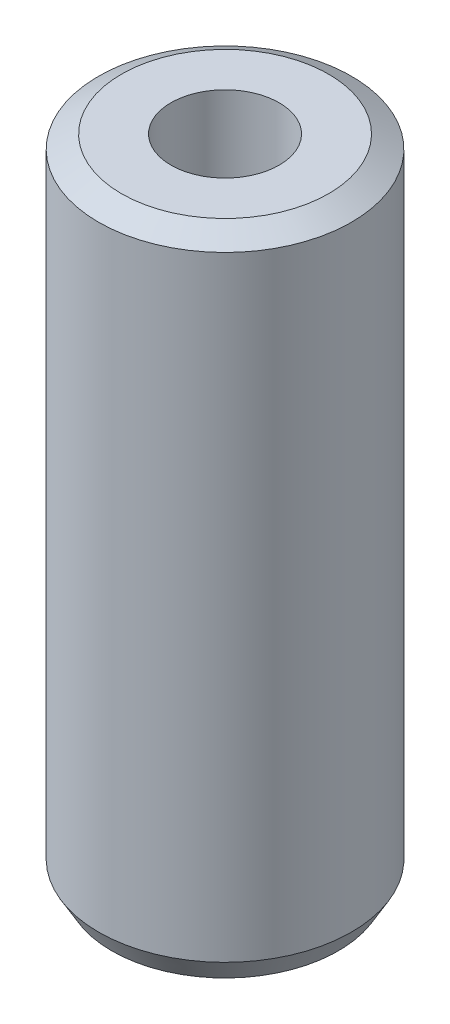
ISO-10303-21;
HEADER;
FILE_DESCRIPTION(('STEP AP214'),'2;1');
FILE_NAME('part.step','',(''),(''),'','','');
FILE_SCHEMA(('AUTOMOTIVE_DESIGN { 1 0 10303 214 1 1 1 1 }'));
ENDSEC;
DATA;
#1=APPLICATION_CONTEXT('core data for automotive mechanical design processes');
#2=APPLICATION_PROTOCOL_DEFINITION('international standard','automotive_design',2000,#1);
#3=PRODUCT_CONTEXT('',#1,'mechanical');
#4=PRODUCT('Part','Part','',(#3));
#5=PRODUCT_RELATED_PRODUCT_CATEGORY('part','',(#4));
#6=PRODUCT_DEFINITION_FORMATION('','',#4);
#7=PRODUCT_DEFINITION_CONTEXT('part definition',#1,'design');
#8=PRODUCT_DEFINITION('design','',#6,#7);
#9=PRODUCT_DEFINITION_SHAPE('','',#8);
#10=(LENGTH_UNIT() NAMED_UNIT(*) SI_UNIT(.MILLI.,.METRE.));
#11=(NAMED_UNIT(*) PLANE_ANGLE_UNIT() SI_UNIT($,.RADIAN.));
#12=(NAMED_UNIT(*) SI_UNIT($,.STERADIAN.) SOLID_ANGLE_UNIT());
#13=UNCERTAINTY_MEASURE_WITH_UNIT(LENGTH_MEASURE(1.E-05),#10,'distance_accuracy_value','');
#14=(GEOMETRIC_REPRESENTATION_CONTEXT(3) GLOBAL_UNCERTAINTY_ASSIGNED_CONTEXT((#13)) GLOBAL_UNIT_ASSIGNED_CONTEXT((#10,
#11,#12)) REPRESENTATION_CONTEXT('',''));
#15=CARTESIAN_POINT('',(0.,0.,0.));
#16=DIRECTION('',(0.,0.,1.));
#17=DIRECTION('',(1.,0.,0.));
#18=AXIS2_PLACEMENT_3D('',#15,#16,#17);
#19=CARTESIAN_POINT('',(0.,231.583665845581,0.));
#20=DIRECTION('',(0.,-1.,0.));
#21=DIRECTION('',(0.,0.,-1.));
#22=AXIS2_PLACEMENT_3D('',#19,#20,#21);
#23=CYLINDRICAL_SURFACE('',#22,45.);
#24=CARTESIAN_POINT('',(0.,226.878388832589,0.));
#25=DIRECTION('',(0.,1.,0.));
#26=DIRECTION('',(0.,0.,1.));
#27=AXIS2_PLACEMENT_3D('',#24,#25,#26);
#28=CIRCLE('',#27,45.);
#29=CARTESIAN_POINT('',(0.,226.878388832589,45.));
#30=VERTEX_POINT('',#29);
#31=EDGE_CURVE('E50',#30,#30,#28,.F.);
#32=ORIENTED_EDGE('',*,*,#31,.T.);
#33=EDGE_LOOP('',(#32));
#34=FACE_BOUND('',#33,.T.);
#35=CARTESIAN_POINT('',(0.,8.14977885018772,0.));
#36=DIRECTION('',(0.,1.,0.));
#37=DIRECTION('',(0.,0.,1.));
#38=AXIS2_PLACEMENT_3D('',#35,#36,#37);
#39=CIRCLE('',#38,45.);
#40=CARTESIAN_POINT('',(0.,8.14977885018772,45.));
#41=VERTEX_POINT('',#40);
#42=EDGE_CURVE('E51',#41,#41,#39,.T.);
#43=ORIENTED_EDGE('',*,*,#42,.T.);
#44=EDGE_LOOP('',(#43));
#45=FACE_BOUND('',#44,.T.);
#46=ADVANCED_FACE('F39',(#34,#45),#23,.T.);
#47=CARTESIAN_POINT('',(0.,231.583665845581,0.));
#48=DIRECTION('',(0.,1.,0.));
#49=DIRECTION('',(0.,0.,1.));
#50=AXIS2_PLACEMENT_3D('',#47,#48,#49);
#51=PLANE('',#50);
#52=CARTESIAN_POINT('',(0.,231.583665845581,0.));
#53=DIRECTION('',(0.,1.,0.));
#54=DIRECTION('',(0.,0.,1.));
#55=AXIS2_PLACEMENT_3D('',#52,#53,#54);
#56=CIRCLE('',#55,36.8502211498124);
#57=CARTESIAN_POINT('',(0.,231.583665845581,36.8502211498124));
#58=VERTEX_POINT('',#57);
#59=EDGE_CURVE('E54',#58,#58,#56,.T.);
#60=ORIENTED_EDGE('',*,*,#59,.T.);
#61=EDGE_LOOP('',(#60));
#62=FACE_BOUND('',#61,.T.);
#63=CARTESIAN_POINT('',(0.,231.583665845581,0.));
#64=DIRECTION('',(0.,1.,0.));
#65=DIRECTION('',(0.,0.,1.));
#66=AXIS2_PLACEMENT_3D('',#63,#64,#65);
#67=CIRCLE('',#66,19.2531426850835);
#68=CARTESIAN_POINT('',(0.,231.583665845581,19.2531426850835));
#69=VERTEX_POINT('',#68);
#70=EDGE_CURVE('E58',#69,#69,#67,.T.);
#71=ORIENTED_EDGE('',*,*,#70,.F.);
#72=EDGE_LOOP('',(#71));
#73=FACE_BOUND('',#72,.T.);
#74=ADVANCED_FACE('F69',(#62,#73),#51,.T.);
#75=CARTESIAN_POINT('',(0.,0.,0.));
#76=DIRECTION('',(0.,1.,0.));
#77=DIRECTION('',(0.,0.,1.));
#78=AXIS2_PLACEMENT_3D('',#75,#76,#77);
#79=PLANE('',#78);
#80=CARTESIAN_POINT('',(0.,0.,0.));
#81=DIRECTION('',(0.,1.,0.));
#82=DIRECTION('',(0.,0.,1.));
#83=AXIS2_PLACEMENT_3D('',#80,#81,#82);
#84=CIRCLE('',#83,40.2947229870082);
#85=CARTESIAN_POINT('',(0.,0.,40.2947229870082));
#86=VERTEX_POINT('',#85);
#87=EDGE_CURVE('E10',#86,#86,#84,.F.);
#88=ORIENTED_EDGE('',*,*,#87,.T.);
#89=EDGE_LOOP('',(#88));
#90=FACE_BOUND('',#89,.T.);
#91=CARTESIAN_POINT('',(0.,0.,0.));
#92=DIRECTION('',(0.,1.,0.));
#93=DIRECTION('',(0.,0.,1.));
#94=AXIS2_PLACEMENT_3D('',#91,#92,#93);
#95=CIRCLE('',#94,19.2531426850835);
#96=CARTESIAN_POINT('',(0.,0.,19.2531426850835));
#97=VERTEX_POINT('',#96);
#98=EDGE_CURVE('E63',#97,#97,#95,.T.);
#99=ORIENTED_EDGE('',*,*,#98,.T.);
#100=EDGE_LOOP('',(#99));
#101=FACE_BOUND('',#100,.T.);
#102=ADVANCED_FACE('F75',(#90,#101),#79,.F.);
#103=CARTESIAN_POINT('',(0.,231.583665845581,0.));
#104=DIRECTION('',(0.,-1.,0.));
#105=DIRECTION('',(0.,0.,-1.));
#106=AXIS2_PLACEMENT_3D('',#103,#104,#105);
#107=CYLINDRICAL_SURFACE('',#106,19.2531426850835);
#108=ORIENTED_EDGE('',*,*,#70,.T.);
#109=EDGE_LOOP('',(#108));
#110=FACE_BOUND('',#109,.T.);
#111=ORIENTED_EDGE('',*,*,#98,.F.);
#112=EDGE_LOOP('',(#111));
#113=FACE_BOUND('',#112,.T.);
#114=ADVANCED_FACE('F70',(#110,#113),#107,.F.);
#115=CARTESIAN_POINT('',(0.,231.583665845581,0.));
#116=DIRECTION('',(0.,-1.,0.));
#117=DIRECTION('',(0.,0.,-1.));
#118=AXIS2_PLACEMENT_3D('',#115,#116,#117);
#119=CONICAL_SURFACE('',#118,36.8502211498124,1.04719755119659);
#120=ORIENTED_EDGE('',*,*,#31,.F.);
#121=EDGE_LOOP('',(#120));
#122=FACE_BOUND('',#121,.T.);
#123=ORIENTED_EDGE('',*,*,#59,.F.);
#124=EDGE_LOOP('',(#123));
#125=FACE_BOUND('',#124,.T.);
#126=ADVANCED_FACE('F81',(#122,#125),#119,.T.);
#127=CARTESIAN_POINT('',(0.,8.14977885018772,0.));
#128=DIRECTION('',(0.,1.,0.));
#129=DIRECTION('',(0.,0.,1.));
#130=AXIS2_PLACEMENT_3D('',#127,#128,#129);
#131=CONICAL_SURFACE('',#130,45.,0.523598775598302);
#132=ORIENTED_EDGE('',*,*,#87,.F.);
#133=EDGE_LOOP('',(#132));
#134=FACE_BOUND('',#133,.T.);
#135=ORIENTED_EDGE('',*,*,#42,.F.);
#136=EDGE_LOOP('',(#135));
#137=FACE_BOUND('',#136,.T.);
#138=ADVANCED_FACE('F45',(#134,#137),#131,.T.);
#139=CLOSED_SHELL('',(#46,#74,#102,#114,#126,#138));
#140=MANIFOLD_SOLID_BREP('B2',#139);
#141=ADVANCED_BREP_SHAPE_REPRESENTATION('',(#18,#140),#14);
#142=SHAPE_DEFINITION_REPRESENTATION(#9,#141);
ENDSEC;
END-ISO-10303-21;
